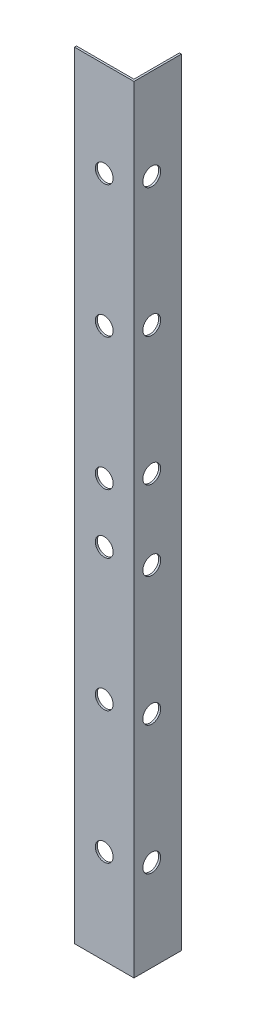
ISO-10303-21;
HEADER;
FILE_DESCRIPTION(('STEP AP214'),'2;1');
FILE_NAME('part.step','',(''),(''),'','','');
FILE_SCHEMA(('AUTOMOTIVE_DESIGN { 1 0 10303 214 1 1 1 1 }'));
ENDSEC;
DATA;
#1=APPLICATION_CONTEXT('core data for automotive mechanical design processes');
#2=APPLICATION_PROTOCOL_DEFINITION('international standard','automotive_design',2000,#1);
#3=PRODUCT_CONTEXT('',#1,'mechanical');
#4=PRODUCT('Part','Part','',(#3));
#5=PRODUCT_RELATED_PRODUCT_CATEGORY('part','',(#4));
#6=PRODUCT_DEFINITION_FORMATION('','',#4);
#7=PRODUCT_DEFINITION_CONTEXT('part definition',#1,'design');
#8=PRODUCT_DEFINITION('design','',#6,#7);
#9=PRODUCT_DEFINITION_SHAPE('','',#8);
#10=(LENGTH_UNIT() NAMED_UNIT(*) SI_UNIT(.MILLI.,.METRE.));
#11=(NAMED_UNIT(*) PLANE_ANGLE_UNIT() SI_UNIT($,.RADIAN.));
#12=(NAMED_UNIT(*) SI_UNIT($,.STERADIAN.) SOLID_ANGLE_UNIT());
#13=UNCERTAINTY_MEASURE_WITH_UNIT(LENGTH_MEASURE(1.E-05),#10,'distance_accuracy_value','');
#14=(GEOMETRIC_REPRESENTATION_CONTEXT(3) GLOBAL_UNCERTAINTY_ASSIGNED_CONTEXT((#13)) GLOBAL_UNIT_ASSIGNED_CONTEXT((#10,
#11,#12)) REPRESENTATION_CONTEXT('',''));
#15=CARTESIAN_POINT('',(0.,0.,0.));
#16=DIRECTION('',(0.,0.,1.));
#17=DIRECTION('',(1.,0.,0.));
#18=AXIS2_PLACEMENT_3D('',#15,#16,#17);
#19=CARTESIAN_POINT('',(0.,196.,-0.5));
#20=DIRECTION('',(1.,0.,0.));
#21=DIRECTION('',(0.,0.,-1.));
#22=AXIS2_PLACEMENT_3D('',#19,#20,#21);
#23=PLANE('',#22);
#24=DIRECTION('',(0.,0.,1.));
#25=VECTOR('',#24,1.);
#26=CARTESIAN_POINT('',(0.,0.,-0.5));
#27=LINE('',#26,#25);
#28=CARTESIAN_POINT('',(0.,0.,-0.5));
#29=VERTEX_POINT('',#28);
#30=CARTESIAN_POINT('',(0.,0.,0.));
#31=VERTEX_POINT('',#30);
#32=EDGE_CURVE('E123',#29,#31,#27,.T.);
#33=ORIENTED_EDGE('',*,*,#32,.T.);
#34=DIRECTION('',(0.,-1.,0.));
#35=VECTOR('',#34,1.);
#36=CARTESIAN_POINT('',(0.,196.,0.));
#37=LINE('',#36,#35);
#38=CARTESIAN_POINT('',(0.,196.,0.));
#39=VERTEX_POINT('',#38);
#40=EDGE_CURVE('E11',#39,#31,#37,.T.);
#41=ORIENTED_EDGE('',*,*,#40,.F.);
#42=DIRECTION('',(0.,0.,1.));
#43=VECTOR('',#42,1.);
#44=CARTESIAN_POINT('',(0.,196.,-0.5));
#45=LINE('',#44,#43);
#46=CARTESIAN_POINT('',(0.,196.,-0.5));
#47=VERTEX_POINT('',#46);
#48=EDGE_CURVE('E134',#47,#39,#45,.T.);
#49=ORIENTED_EDGE('',*,*,#48,.F.);
#50=DIRECTION('',(0.,-1.,0.));
#51=VECTOR('',#50,1.);
#52=CARTESIAN_POINT('',(0.,196.,-0.5));
#53=LINE('',#52,#51);
#54=EDGE_CURVE('E119',#47,#29,#53,.T.);
#55=ORIENTED_EDGE('',*,*,#54,.T.);
#56=EDGE_LOOP('',(#33,#41,#49,#55));
#57=FACE_BOUND('',#56,.T.);
#58=ADVANCED_FACE('F39',(#57),#23,.F.);
#59=CARTESIAN_POINT('',(0.,196.,0.));
#60=DIRECTION('',(0.,0.,-1.));
#61=DIRECTION('',(-1.,0.,0.));
#62=AXIS2_PLACEMENT_3D('',#59,#60,#61);
#63=PLANE('',#62);
#64=CARTESIAN_POINT('',(7.49999999999998,23.8333333333333,0.));
#65=DIRECTION('',(0.,0.,1.));
#66=DIRECTION('',(1.,0.,0.));
#67=AXIS2_PLACEMENT_3D('',#64,#65,#66);
#68=CIRCLE('',#67,2.24999999999999);
#69=CARTESIAN_POINT('',(9.74999999999997,23.8333333333333,0.));
#70=VERTEX_POINT('',#69);
#71=EDGE_CURVE('E421',#70,#70,#68,.T.);
#72=ORIENTED_EDGE('',*,*,#71,.F.);
#73=EDGE_LOOP('',(#72));
#74=FACE_BOUND('',#73,.T.);
#75=CARTESIAN_POINT('',(7.49999999999997,57.1666666666667,0.));
#76=DIRECTION('',(0.,0.,1.));
#77=DIRECTION('',(1.,0.,0.));
#78=AXIS2_PLACEMENT_3D('',#75,#76,#77);
#79=CIRCLE('',#78,2.24999999999999);
#80=CARTESIAN_POINT('',(9.74999999999996,57.1666666666667,0.));
#81=VERTEX_POINT('',#80);
#82=EDGE_CURVE('E429',#81,#81,#79,.T.);
#83=ORIENTED_EDGE('',*,*,#82,.F.);
#84=EDGE_LOOP('',(#83));
#85=FACE_BOUND('',#84,.T.);
#86=CARTESIAN_POINT('',(7.49999999999997,90.5,0.));
#87=DIRECTION('',(0.,0.,1.));
#88=DIRECTION('',(1.,0.,0.));
#89=AXIS2_PLACEMENT_3D('',#86,#87,#88);
#90=CIRCLE('',#89,2.25);
#91=CARTESIAN_POINT('',(9.74999999999997,90.5,0.));
#92=VERTEX_POINT('',#91);
#93=EDGE_CURVE('E435',#92,#92,#90,.T.);
#94=ORIENTED_EDGE('',*,*,#93,.F.);
#95=EDGE_LOOP('',(#94));
#96=FACE_BOUND('',#95,.T.);
#97=CARTESIAN_POINT('',(7.49999999999997,105.5,0.));
#98=DIRECTION('',(0.,0.,1.));
#99=DIRECTION('',(1.,0.,0.));
#100=AXIS2_PLACEMENT_3D('',#97,#98,#99);
#101=CIRCLE('',#100,2.25);
#102=CARTESIAN_POINT('',(9.74999999999997,105.5,0.));
#103=VERTEX_POINT('',#102);
#104=EDGE_CURVE('E441',#103,#103,#101,.T.);
#105=ORIENTED_EDGE('',*,*,#104,.F.);
#106=EDGE_LOOP('',(#105));
#107=FACE_BOUND('',#106,.T.);
#108=CARTESIAN_POINT('',(7.49999999999997,138.833333333333,0.));
#109=DIRECTION('',(0.,0.,1.));
#110=DIRECTION('',(1.,0.,0.));
#111=AXIS2_PLACEMENT_3D('',#108,#109,#110);
#112=CIRCLE('',#111,2.25);
#113=CARTESIAN_POINT('',(9.74999999999997,138.833333333333,0.));
#114=VERTEX_POINT('',#113);
#115=EDGE_CURVE('E447',#114,#114,#112,.T.);
#116=ORIENTED_EDGE('',*,*,#115,.F.);
#117=EDGE_LOOP('',(#116));
#118=FACE_BOUND('',#117,.T.);
#119=CARTESIAN_POINT('',(7.49999999999998,172.166666666667,0.));
#120=DIRECTION('',(0.,0.,1.));
#121=DIRECTION('',(1.,0.,0.));
#122=AXIS2_PLACEMENT_3D('',#119,#120,#121);
#123=CIRCLE('',#122,2.25);
#124=CARTESIAN_POINT('',(9.74999999999998,172.166666666667,0.));
#125=VERTEX_POINT('',#124);
#126=EDGE_CURVE('E453',#125,#125,#123,.T.);
#127=ORIENTED_EDGE('',*,*,#126,.F.);
#128=EDGE_LOOP('',(#127));
#129=FACE_BOUND('',#128,.T.);
#130=DIRECTION('',(1.,0.,0.));
#131=VECTOR('',#130,1.);
#132=CARTESIAN_POINT('',(0.,0.,0.));
#133=LINE('',#132,#131);
#134=CARTESIAN_POINT('',(15.,0.,0.));
#135=VERTEX_POINT('',#134);
#136=EDGE_CURVE('E126',#31,#135,#133,.T.);
#137=ORIENTED_EDGE('',*,*,#136,.T.);
#138=DIRECTION('',(0.,-1.,0.));
#139=VECTOR('',#138,1.);
#140=CARTESIAN_POINT('',(15.,196.,0.));
#141=LINE('',#140,#139);
#142=CARTESIAN_POINT('',(15.,196.,0.));
#143=VERTEX_POINT('',#142);
#144=EDGE_CURVE('E47',#143,#135,#141,.T.);
#145=ORIENTED_EDGE('',*,*,#144,.F.);
#146=DIRECTION('',(1.,0.,0.));
#147=VECTOR('',#146,1.);
#148=CARTESIAN_POINT('',(0.,196.,0.));
#149=LINE('',#148,#147);
#150=EDGE_CURVE('E92',#39,#143,#149,.T.);
#151=ORIENTED_EDGE('',*,*,#150,.F.);
#152=ORIENTED_EDGE('',*,*,#40,.T.);
#153=EDGE_LOOP('',(#137,#145,#151,#152));
#154=FACE_BOUND('',#153,.T.);
#155=ADVANCED_FACE('F164',(#74,#85,#96,#107,#118,#129,#154),#63,.F.);
#156=CARTESIAN_POINT('',(15.,196.,0.));
#157=DIRECTION('',(-1.,0.,0.));
#158=DIRECTION('',(0.,0.,1.));
#159=AXIS2_PLACEMENT_3D('',#156,#157,#158);
#160=PLANE('',#159);
#161=CARTESIAN_POINT('',(15.,23.,-4.49999999999989));
#162=DIRECTION('',(1.,0.,0.));
#163=DIRECTION('',(0.,0.,-1.));
#164=AXIS2_PLACEMENT_3D('',#161,#162,#163);
#165=CIRCLE('',#164,2.25);
#166=CARTESIAN_POINT('',(15.,23.,-6.74999999999989));
#167=VERTEX_POINT('',#166);
#168=EDGE_CURVE('E461',#167,#167,#165,.T.);
#169=ORIENTED_EDGE('',*,*,#168,.F.);
#170=EDGE_LOOP('',(#169));
#171=FACE_BOUND('',#170,.T.);
#172=CARTESIAN_POINT('',(15.,55.5,-4.49999999999992));
#173=DIRECTION('',(1.,0.,0.));
#174=DIRECTION('',(0.,0.,-1.));
#175=AXIS2_PLACEMENT_3D('',#172,#173,#174);
#176=CIRCLE('',#175,2.25);
#177=CARTESIAN_POINT('',(15.,55.5,-6.74999999999992));
#178=VERTEX_POINT('',#177);
#179=EDGE_CURVE('E464',#178,#178,#176,.T.);
#180=ORIENTED_EDGE('',*,*,#179,.F.);
#181=EDGE_LOOP('',(#180));
#182=FACE_BOUND('',#181,.T.);
#183=CARTESIAN_POINT('',(15.,88.0000000000001,-4.50000000000003));
#184=DIRECTION('',(1.,0.,0.));
#185=DIRECTION('',(0.,0.,-1.));
#186=AXIS2_PLACEMENT_3D('',#183,#184,#185);
#187=CIRCLE('',#186,2.25);
#188=CARTESIAN_POINT('',(15.,88.0000000000001,-6.75000000000003));
#189=VERTEX_POINT('',#188);
#190=EDGE_CURVE('E470',#189,#189,#187,.T.);
#191=ORIENTED_EDGE('',*,*,#190,.F.);
#192=EDGE_LOOP('',(#191));
#193=FACE_BOUND('',#192,.T.);
#194=CARTESIAN_POINT('',(15.,108.,-4.50000000000003));
#195=DIRECTION('',(1.,0.,0.));
#196=DIRECTION('',(0.,0.,-1.));
#197=AXIS2_PLACEMENT_3D('',#194,#195,#196);
#198=CIRCLE('',#197,2.25);
#199=CARTESIAN_POINT('',(15.,108.,-6.75000000000003));
#200=VERTEX_POINT('',#199);
#201=EDGE_CURVE('E476',#200,#200,#198,.T.);
#202=ORIENTED_EDGE('',*,*,#201,.F.);
#203=EDGE_LOOP('',(#202));
#204=FACE_BOUND('',#203,.T.);
#205=CARTESIAN_POINT('',(15.,140.5,-4.49999999999992));
#206=DIRECTION('',(1.,0.,0.));
#207=DIRECTION('',(0.,0.,-1.));
#208=AXIS2_PLACEMENT_3D('',#205,#206,#207);
#209=CIRCLE('',#208,2.25);
#210=CARTESIAN_POINT('',(15.,140.5,-6.74999999999992));
#211=VERTEX_POINT('',#210);
#212=EDGE_CURVE('E482',#211,#211,#209,.T.);
#213=ORIENTED_EDGE('',*,*,#212,.F.);
#214=EDGE_LOOP('',(#213));
#215=FACE_BOUND('',#214,.T.);
#216=CARTESIAN_POINT('',(15.,173.,-4.49999999999995));
#217=DIRECTION('',(1.,0.,0.));
#218=DIRECTION('',(0.,0.,-1.));
#219=AXIS2_PLACEMENT_3D('',#216,#217,#218);
#220=CIRCLE('',#219,2.25);
#221=CARTESIAN_POINT('',(15.,173.,-6.74999999999995));
#222=VERTEX_POINT('',#221);
#223=EDGE_CURVE('E427',#222,#222,#220,.T.);
#224=ORIENTED_EDGE('',*,*,#223,.F.);
#225=EDGE_LOOP('',(#224));
#226=FACE_BOUND('',#225,.T.);
#227=DIRECTION('',(0.,0.,-1.));
#228=VECTOR('',#227,1.);
#229=CARTESIAN_POINT('',(15.,0.,0.));
#230=LINE('',#229,#228);
#231=CARTESIAN_POINT('',(15.,0.,-12.));
#232=VERTEX_POINT('',#231);
#233=EDGE_CURVE('E129',#135,#232,#230,.T.);
#234=ORIENTED_EDGE('',*,*,#233,.T.);
#235=DIRECTION('',(0.,-1.,0.));
#236=VECTOR('',#235,1.);
#237=CARTESIAN_POINT('',(15.,196.,-12.));
#238=LINE('',#237,#236);
#239=CARTESIAN_POINT('',(15.,196.,-12.));
#240=VERTEX_POINT('',#239);
#241=EDGE_CURVE('E114',#240,#232,#238,.T.);
#242=ORIENTED_EDGE('',*,*,#241,.F.);
#243=DIRECTION('',(0.,0.,-1.));
#244=VECTOR('',#243,1.);
#245=CARTESIAN_POINT('',(15.,196.,0.));
#246=LINE('',#245,#244);
#247=EDGE_CURVE('E105',#143,#240,#246,.T.);
#248=ORIENTED_EDGE('',*,*,#247,.F.);
#249=ORIENTED_EDGE('',*,*,#144,.T.);
#250=EDGE_LOOP('',(#234,#242,#248,#249));
#251=FACE_BOUND('',#250,.T.);
#252=ADVANCED_FACE('F140',(#171,#182,#193,#204,#215,#226,#251),#160,.F.);
#253=CARTESIAN_POINT('',(15.,196.,-12.));
#254=DIRECTION('',(0.,0.,1.));
#255=DIRECTION('',(1.,0.,0.));
#256=AXIS2_PLACEMENT_3D('',#253,#254,#255);
#257=PLANE('',#256);
#258=DIRECTION('',(-1.,0.,0.));
#259=VECTOR('',#258,1.);
#260=CARTESIAN_POINT('',(15.,0.,-12.));
#261=LINE('',#260,#259);
#262=CARTESIAN_POINT('',(14.5,0.,-12.));
#263=VERTEX_POINT('',#262);
#264=EDGE_CURVE('E113',#232,#263,#261,.T.);
#265=ORIENTED_EDGE('',*,*,#264,.T.);
#266=DIRECTION('',(0.,-1.,0.));
#267=VECTOR('',#266,1.);
#268=CARTESIAN_POINT('',(14.5,196.,-12.));
#269=LINE('',#268,#267);
#270=CARTESIAN_POINT('',(14.5,196.,-12.));
#271=VERTEX_POINT('',#270);
#272=EDGE_CURVE('E110',#271,#263,#269,.T.);
#273=ORIENTED_EDGE('',*,*,#272,.F.);
#274=DIRECTION('',(-1.,0.,0.));
#275=VECTOR('',#274,1.);
#276=CARTESIAN_POINT('',(15.,196.,-12.));
#277=LINE('',#276,#275);
#278=EDGE_CURVE('E99',#240,#271,#277,.T.);
#279=ORIENTED_EDGE('',*,*,#278,.F.);
#280=ORIENTED_EDGE('',*,*,#241,.T.);
#281=EDGE_LOOP('',(#265,#273,#279,#280));
#282=FACE_BOUND('',#281,.T.);
#283=ADVANCED_FACE('F111',(#282),#257,.F.);
#284=CARTESIAN_POINT('',(14.5,196.,-12.));
#285=DIRECTION('',(1.,0.,0.));
#286=DIRECTION('',(0.,0.,-1.));
#287=AXIS2_PLACEMENT_3D('',#284,#285,#286);
#288=PLANE('',#287);
#289=CARTESIAN_POINT('',(14.5,23.,-4.49999999999989));
#290=DIRECTION('',(1.,0.,0.));
#291=DIRECTION('',(0.,0.,-1.));
#292=AXIS2_PLACEMENT_3D('',#289,#290,#291);
#293=CIRCLE('',#292,2.25);
#294=CARTESIAN_POINT('',(14.5,23.,-6.7499999999999));
#295=VERTEX_POINT('',#294);
#296=EDGE_CURVE('E127',#295,#295,#293,.F.);
#297=ORIENTED_EDGE('',*,*,#296,.F.);
#298=EDGE_LOOP('',(#297));
#299=FACE_BOUND('',#298,.T.);
#300=CARTESIAN_POINT('',(14.5,55.5,-4.49999999999992));
#301=DIRECTION('',(1.,0.,0.));
#302=DIRECTION('',(0.,0.,-1.));
#303=AXIS2_PLACEMENT_3D('',#300,#301,#302);
#304=CIRCLE('',#303,2.25);
#305=CARTESIAN_POINT('',(14.5,55.5,-6.74999999999992));
#306=VERTEX_POINT('',#305);
#307=EDGE_CURVE('E467',#306,#306,#304,.F.);
#308=ORIENTED_EDGE('',*,*,#307,.F.);
#309=EDGE_LOOP('',(#308));
#310=FACE_BOUND('',#309,.T.);
#311=CARTESIAN_POINT('',(14.5,88.0000000000001,-4.50000000000003));
#312=DIRECTION('',(1.,0.,0.));
#313=DIRECTION('',(0.,0.,-1.));
#314=AXIS2_PLACEMENT_3D('',#311,#312,#313);
#315=CIRCLE('',#314,2.25);
#316=CARTESIAN_POINT('',(14.5,88.0000000000001,-6.75000000000003));
#317=VERTEX_POINT('',#316);
#318=EDGE_CURVE('E473',#317,#317,#315,.F.);
#319=ORIENTED_EDGE('',*,*,#318,.F.);
#320=EDGE_LOOP('',(#319));
#321=FACE_BOUND('',#320,.T.);
#322=CARTESIAN_POINT('',(14.5,108.,-4.50000000000003));
#323=DIRECTION('',(1.,0.,0.));
#324=DIRECTION('',(0.,0.,-1.));
#325=AXIS2_PLACEMENT_3D('',#322,#323,#324);
#326=CIRCLE('',#325,2.25);
#327=CARTESIAN_POINT('',(14.5,108.,-6.75000000000004));
#328=VERTEX_POINT('',#327);
#329=EDGE_CURVE('E479',#328,#328,#326,.F.);
#330=ORIENTED_EDGE('',*,*,#329,.F.);
#331=EDGE_LOOP('',(#330));
#332=FACE_BOUND('',#331,.T.);
#333=CARTESIAN_POINT('',(14.5,140.5,-4.49999999999992));
#334=DIRECTION('',(1.,0.,0.));
#335=DIRECTION('',(0.,0.,-1.));
#336=AXIS2_PLACEMENT_3D('',#333,#334,#335);
#337=CIRCLE('',#336,2.25);
#338=CARTESIAN_POINT('',(14.5,140.5,-6.74999999999992));
#339=VERTEX_POINT('',#338);
#340=EDGE_CURVE('E485',#339,#339,#337,.F.);
#341=ORIENTED_EDGE('',*,*,#340,.F.);
#342=EDGE_LOOP('',(#341));
#343=FACE_BOUND('',#342,.T.);
#344=CARTESIAN_POINT('',(14.5,173.,-4.49999999999995));
#345=DIRECTION('',(1.,0.,0.));
#346=DIRECTION('',(0.,0.,-1.));
#347=AXIS2_PLACEMENT_3D('',#344,#345,#346);
#348=CIRCLE('',#347,2.25);
#349=CARTESIAN_POINT('',(14.5,173.,-6.74999999999995));
#350=VERTEX_POINT('',#349);
#351=EDGE_CURVE('E424',#350,#350,#348,.F.);
#352=ORIENTED_EDGE('',*,*,#351,.F.);
#353=EDGE_LOOP('',(#352));
#354=FACE_BOUND('',#353,.T.);
#355=DIRECTION('',(0.,0.,1.));
#356=VECTOR('',#355,1.);
#357=CARTESIAN_POINT('',(14.5,0.,-12.));
#358=LINE('',#357,#356);
#359=CARTESIAN_POINT('',(14.5,0.,-0.500000000000002));
#360=VERTEX_POINT('',#359);
#361=EDGE_CURVE('E78',#263,#360,#358,.T.);
#362=ORIENTED_EDGE('',*,*,#361,.T.);
#363=DIRECTION('',(0.,-1.,0.));
#364=VECTOR('',#363,1.);
#365=CARTESIAN_POINT('',(14.5,196.,-0.500000000000002));
#366=LINE('',#365,#364);
#367=CARTESIAN_POINT('',(14.5,196.,-0.500000000000002));
#368=VERTEX_POINT('',#367);
#369=EDGE_CURVE('E115',#368,#360,#366,.T.);
#370=ORIENTED_EDGE('',*,*,#369,.F.);
#371=DIRECTION('',(0.,0.,1.));
#372=VECTOR('',#371,1.);
#373=CARTESIAN_POINT('',(14.5,196.,-12.));
#374=LINE('',#373,#372);
#375=EDGE_CURVE('E103',#271,#368,#374,.T.);
#376=ORIENTED_EDGE('',*,*,#375,.F.);
#377=ORIENTED_EDGE('',*,*,#272,.T.);
#378=EDGE_LOOP('',(#362,#370,#376,#377));
#379=FACE_BOUND('',#378,.T.);
#380=ADVANCED_FACE('F117',(#299,#310,#321,#332,#343,#354,#379),#288,.F.);
#381=CARTESIAN_POINT('',(14.5,196.,-0.500000000000002));
#382=DIRECTION('',(0.,0.,1.));
#383=DIRECTION('',(1.,0.,0.));
#384=AXIS2_PLACEMENT_3D('',#381,#382,#383);
#385=PLANE('',#384);
#386=CARTESIAN_POINT('',(7.49999999999998,23.8333333333333,-0.500000000000002));
#387=DIRECTION('',(0.,0.,1.));
#388=DIRECTION('',(1.,0.,0.));
#389=AXIS2_PLACEMENT_3D('',#386,#387,#388);
#390=CIRCLE('',#389,2.24999999999999);
#391=CARTESIAN_POINT('',(9.74999999999997,23.8333333333333,-0.500000000000002));
#392=VERTEX_POINT('',#391);
#393=EDGE_CURVE('E423',#392,#392,#390,.F.);
#394=ORIENTED_EDGE('',*,*,#393,.F.);
#395=EDGE_LOOP('',(#394));
#396=FACE_BOUND('',#395,.T.);
#397=CARTESIAN_POINT('',(7.49999999999997,57.1666666666667,-0.500000000000002));
#398=DIRECTION('',(0.,0.,1.));
#399=DIRECTION('',(1.,0.,0.));
#400=AXIS2_PLACEMENT_3D('',#397,#398,#399);
#401=CIRCLE('',#400,2.24999999999999);
#402=CARTESIAN_POINT('',(9.74999999999996,57.1666666666667,-0.500000000000002));
#403=VERTEX_POINT('',#402);
#404=EDGE_CURVE('E432',#403,#403,#401,.F.);
#405=ORIENTED_EDGE('',*,*,#404,.F.);
#406=EDGE_LOOP('',(#405));
#407=FACE_BOUND('',#406,.T.);
#408=CARTESIAN_POINT('',(7.49999999999997,90.5,-0.500000000000002));
#409=DIRECTION('',(0.,0.,1.));
#410=DIRECTION('',(1.,0.,0.));
#411=AXIS2_PLACEMENT_3D('',#408,#409,#410);
#412=CIRCLE('',#411,2.25);
#413=CARTESIAN_POINT('',(9.74999999999997,90.5,-0.500000000000002));
#414=VERTEX_POINT('',#413);
#415=EDGE_CURVE('E438',#414,#414,#412,.F.);
#416=ORIENTED_EDGE('',*,*,#415,.F.);
#417=EDGE_LOOP('',(#416));
#418=FACE_BOUND('',#417,.T.);
#419=CARTESIAN_POINT('',(7.49999999999997,105.5,-0.500000000000002));
#420=DIRECTION('',(0.,0.,1.));
#421=DIRECTION('',(1.,0.,0.));
#422=AXIS2_PLACEMENT_3D('',#419,#420,#421);
#423=CIRCLE('',#422,2.25);
#424=CARTESIAN_POINT('',(9.74999999999997,105.5,-0.500000000000002));
#425=VERTEX_POINT('',#424);
#426=EDGE_CURVE('E444',#425,#425,#423,.F.);
#427=ORIENTED_EDGE('',*,*,#426,.F.);
#428=EDGE_LOOP('',(#427));
#429=FACE_BOUND('',#428,.T.);
#430=CARTESIAN_POINT('',(7.49999999999997,138.833333333333,-0.500000000000002));
#431=DIRECTION('',(0.,0.,1.));
#432=DIRECTION('',(1.,0.,0.));
#433=AXIS2_PLACEMENT_3D('',#430,#431,#432);
#434=CIRCLE('',#433,2.25);
#435=CARTESIAN_POINT('',(9.74999999999997,138.833333333333,-0.500000000000002));
#436=VERTEX_POINT('',#435);
#437=EDGE_CURVE('E450',#436,#436,#434,.F.);
#438=ORIENTED_EDGE('',*,*,#437,.F.);
#439=EDGE_LOOP('',(#438));
#440=FACE_BOUND('',#439,.T.);
#441=CARTESIAN_POINT('',(7.49999999999998,172.166666666667,-0.500000000000002));
#442=DIRECTION('',(0.,0.,1.));
#443=DIRECTION('',(1.,0.,0.));
#444=AXIS2_PLACEMENT_3D('',#441,#442,#443);
#445=CIRCLE('',#444,2.25);
#446=CARTESIAN_POINT('',(9.74999999999998,172.166666666667,-0.500000000000002));
#447=VERTEX_POINT('',#446);
#448=EDGE_CURVE('E456',#447,#447,#445,.F.);
#449=ORIENTED_EDGE('',*,*,#448,.F.);
#450=EDGE_LOOP('',(#449));
#451=FACE_BOUND('',#450,.T.);
#452=DIRECTION('',(-1.,0.,0.));
#453=VECTOR('',#452,1.);
#454=CARTESIAN_POINT('',(14.5,0.,-0.500000000000002));
#455=LINE('',#454,#453);
#456=EDGE_CURVE('E84',#360,#29,#455,.T.);
#457=ORIENTED_EDGE('',*,*,#456,.T.);
#458=ORIENTED_EDGE('',*,*,#54,.F.);
#459=DIRECTION('',(-1.,0.,0.));
#460=VECTOR('',#459,1.);
#461=CARTESIAN_POINT('',(14.5,196.,-0.500000000000002));
#462=LINE('',#461,#460);
#463=EDGE_CURVE('E55',#368,#47,#462,.T.);
#464=ORIENTED_EDGE('',*,*,#463,.F.);
#465=ORIENTED_EDGE('',*,*,#369,.T.);
#466=EDGE_LOOP('',(#457,#458,#464,#465));
#467=FACE_BOUND('',#466,.T.);
#468=ADVANCED_FACE('F147',(#396,#407,#418,#429,#440,#451,#467),#385,.F.);
#469=CARTESIAN_POINT('',(0.,196.,0.));
#470=DIRECTION('',(0.,1.,0.));
#471=DIRECTION('',(0.,0.,1.));
#472=AXIS2_PLACEMENT_3D('',#469,#470,#471);
#473=PLANE('',#472);
#474=ORIENTED_EDGE('',*,*,#48,.T.);
#475=ORIENTED_EDGE('',*,*,#150,.T.);
#476=ORIENTED_EDGE('',*,*,#247,.T.);
#477=ORIENTED_EDGE('',*,*,#278,.T.);
#478=ORIENTED_EDGE('',*,*,#375,.T.);
#479=ORIENTED_EDGE('',*,*,#463,.T.);
#480=EDGE_LOOP('',(#474,#475,#476,#477,#478,#479));
#481=FACE_BOUND('',#480,.T.);
#482=ADVANCED_FACE('F101',(#481),#473,.T.);
#483=CARTESIAN_POINT('',(0.,0.,0.));
#484=DIRECTION('',(0.,1.,0.));
#485=DIRECTION('',(0.,0.,1.));
#486=AXIS2_PLACEMENT_3D('',#483,#484,#485);
#487=PLANE('',#486);
#488=ORIENTED_EDGE('',*,*,#32,.F.);
#489=ORIENTED_EDGE('',*,*,#456,.F.);
#490=ORIENTED_EDGE('',*,*,#361,.F.);
#491=ORIENTED_EDGE('',*,*,#264,.F.);
#492=ORIENTED_EDGE('',*,*,#233,.F.);
#493=ORIENTED_EDGE('',*,*,#136,.F.);
#494=EDGE_LOOP('',(#488,#489,#490,#491,#492,#493));
#495=FACE_BOUND('',#494,.T.);
#496=ADVANCED_FACE('F143',(#495),#487,.F.);
#497=CARTESIAN_POINT('',(-0.000999999999999265,173.,-4.49999999999995));
#498=DIRECTION('',(1.,0.,0.));
#499=DIRECTION('',(0.,0.,-1.));
#500=AXIS2_PLACEMENT_3D('',#497,#498,#499);
#501=CYLINDRICAL_SURFACE('',#500,2.25);
#502=ORIENTED_EDGE('',*,*,#223,.T.);
#503=EDGE_LOOP('',(#502));
#504=FACE_BOUND('',#503,.T.);
#505=ORIENTED_EDGE('',*,*,#351,.T.);
#506=EDGE_LOOP('',(#505));
#507=FACE_BOUND('',#506,.T.);
#508=ADVANCED_FACE('F204',(#504,#507),#501,.F.);
#509=CARTESIAN_POINT('',(-0.000999999999999265,140.5,-4.49999999999992));
#510=DIRECTION('',(1.,0.,0.));
#511=DIRECTION('',(0.,0.,-1.));
#512=AXIS2_PLACEMENT_3D('',#509,#510,#511);
#513=CYLINDRICAL_SURFACE('',#512,2.25);
#514=ORIENTED_EDGE('',*,*,#212,.T.);
#515=EDGE_LOOP('',(#514));
#516=FACE_BOUND('',#515,.T.);
#517=ORIENTED_EDGE('',*,*,#340,.T.);
#518=EDGE_LOOP('',(#517));
#519=FACE_BOUND('',#518,.T.);
#520=ADVANCED_FACE('F210',(#516,#519),#513,.F.);
#521=CARTESIAN_POINT('',(-0.000999999999999265,108.,-4.50000000000003));
#522=DIRECTION('',(1.,0.,0.));
#523=DIRECTION('',(0.,0.,-1.));
#524=AXIS2_PLACEMENT_3D('',#521,#522,#523);
#525=CYLINDRICAL_SURFACE('',#524,2.25);
#526=ORIENTED_EDGE('',*,*,#201,.T.);
#527=EDGE_LOOP('',(#526));
#528=FACE_BOUND('',#527,.T.);
#529=ORIENTED_EDGE('',*,*,#329,.T.);
#530=EDGE_LOOP('',(#529));
#531=FACE_BOUND('',#530,.T.);
#532=ADVANCED_FACE('F217',(#528,#531),#525,.F.);
#533=CARTESIAN_POINT('',(-0.000999999999999265,88.0000000000001,-4.50000000000003));
#534=DIRECTION('',(1.,0.,0.));
#535=DIRECTION('',(0.,0.,-1.));
#536=AXIS2_PLACEMENT_3D('',#533,#534,#535);
#537=CYLINDRICAL_SURFACE('',#536,2.25);
#538=ORIENTED_EDGE('',*,*,#190,.T.);
#539=EDGE_LOOP('',(#538));
#540=FACE_BOUND('',#539,.T.);
#541=ORIENTED_EDGE('',*,*,#318,.T.);
#542=EDGE_LOOP('',(#541));
#543=FACE_BOUND('',#542,.T.);
#544=ADVANCED_FACE('F225',(#540,#543),#537,.F.);
#545=CARTESIAN_POINT('',(-0.000999999999999265,55.5,-4.49999999999992));
#546=DIRECTION('',(1.,0.,0.));
#547=DIRECTION('',(0.,0.,-1.));
#548=AXIS2_PLACEMENT_3D('',#545,#546,#547);
#549=CYLINDRICAL_SURFACE('',#548,2.25);
#550=ORIENTED_EDGE('',*,*,#179,.T.);
#551=EDGE_LOOP('',(#550));
#552=FACE_BOUND('',#551,.T.);
#553=ORIENTED_EDGE('',*,*,#307,.T.);
#554=EDGE_LOOP('',(#553));
#555=FACE_BOUND('',#554,.T.);
#556=ADVANCED_FACE('F233',(#552,#555),#549,.F.);
#557=CARTESIAN_POINT('',(-0.000999999999999265,23.,-4.49999999999989));
#558=DIRECTION('',(1.,0.,0.));
#559=DIRECTION('',(0.,0.,-1.));
#560=AXIS2_PLACEMENT_3D('',#557,#558,#559);
#561=CYLINDRICAL_SURFACE('',#560,2.25);
#562=ORIENTED_EDGE('',*,*,#168,.T.);
#563=EDGE_LOOP('',(#562));
#564=FACE_BOUND('',#563,.T.);
#565=ORIENTED_EDGE('',*,*,#296,.T.);
#566=EDGE_LOOP('',(#565));
#567=FACE_BOUND('',#566,.T.);
#568=ADVANCED_FACE('F241',(#564,#567),#561,.F.);
#569=CARTESIAN_POINT('',(7.49999999999998,172.166666666667,-12.001));
#570=DIRECTION('',(0.,0.,1.));
#571=DIRECTION('',(1.,0.,0.));
#572=AXIS2_PLACEMENT_3D('',#569,#570,#571);
#573=CYLINDRICAL_SURFACE('',#572,2.25);
#574=ORIENTED_EDGE('',*,*,#126,.T.);
#575=EDGE_LOOP('',(#574));
#576=FACE_BOUND('',#575,.T.);
#577=ORIENTED_EDGE('',*,*,#448,.T.);
#578=EDGE_LOOP('',(#577));
#579=FACE_BOUND('',#578,.T.);
#580=ADVANCED_FACE('F249',(#576,#579),#573,.F.);
#581=CARTESIAN_POINT('',(7.49999999999997,138.833333333333,-12.001));
#582=DIRECTION('',(0.,0.,1.));
#583=DIRECTION('',(1.,0.,0.));
#584=AXIS2_PLACEMENT_3D('',#581,#582,#583);
#585=CYLINDRICAL_SURFACE('',#584,2.25);
#586=ORIENTED_EDGE('',*,*,#115,.T.);
#587=EDGE_LOOP('',(#586));
#588=FACE_BOUND('',#587,.T.);
#589=ORIENTED_EDGE('',*,*,#437,.T.);
#590=EDGE_LOOP('',(#589));
#591=FACE_BOUND('',#590,.T.);
#592=ADVANCED_FACE('F256',(#588,#591),#585,.F.);
#593=CARTESIAN_POINT('',(7.49999999999997,105.5,-12.001));
#594=DIRECTION('',(0.,0.,1.));
#595=DIRECTION('',(1.,0.,0.));
#596=AXIS2_PLACEMENT_3D('',#593,#594,#595);
#597=CYLINDRICAL_SURFACE('',#596,2.25);
#598=ORIENTED_EDGE('',*,*,#104,.T.);
#599=EDGE_LOOP('',(#598));
#600=FACE_BOUND('',#599,.T.);
#601=ORIENTED_EDGE('',*,*,#426,.T.);
#602=EDGE_LOOP('',(#601));
#603=FACE_BOUND('',#602,.T.);
#604=ADVANCED_FACE('F263',(#600,#603),#597,.F.);
#605=CARTESIAN_POINT('',(7.49999999999997,90.5,-12.001));
#606=DIRECTION('',(0.,0.,1.));
#607=DIRECTION('',(1.,0.,0.));
#608=AXIS2_PLACEMENT_3D('',#605,#606,#607);
#609=CYLINDRICAL_SURFACE('',#608,2.25);
#610=ORIENTED_EDGE('',*,*,#93,.T.);
#611=EDGE_LOOP('',(#610));
#612=FACE_BOUND('',#611,.T.);
#613=ORIENTED_EDGE('',*,*,#415,.T.);
#614=EDGE_LOOP('',(#613));
#615=FACE_BOUND('',#614,.T.);
#616=ADVANCED_FACE('F271',(#612,#615),#609,.F.);
#617=CARTESIAN_POINT('',(7.49999999999997,57.1666666666667,-12.001));
#618=DIRECTION('',(0.,0.,1.));
#619=DIRECTION('',(1.,0.,0.));
#620=AXIS2_PLACEMENT_3D('',#617,#618,#619);
#621=CYLINDRICAL_SURFACE('',#620,2.24999999999999);
#622=ORIENTED_EDGE('',*,*,#82,.T.);
#623=EDGE_LOOP('',(#622));
#624=FACE_BOUND('',#623,.T.);
#625=ORIENTED_EDGE('',*,*,#404,.T.);
#626=EDGE_LOOP('',(#625));
#627=FACE_BOUND('',#626,.T.);
#628=ADVANCED_FACE('F279',(#624,#627),#621,.F.);
#629=CARTESIAN_POINT('',(7.49999999999998,23.8333333333333,-12.001));
#630=DIRECTION('',(0.,0.,1.));
#631=DIRECTION('',(1.,0.,0.));
#632=AXIS2_PLACEMENT_3D('',#629,#630,#631);
#633=CYLINDRICAL_SURFACE('',#632,2.24999999999999);
#634=ORIENTED_EDGE('',*,*,#71,.T.);
#635=EDGE_LOOP('',(#634));
#636=FACE_BOUND('',#635,.T.);
#637=ORIENTED_EDGE('',*,*,#393,.T.);
#638=EDGE_LOOP('',(#637));
#639=FACE_BOUND('',#638,.T.);
#640=ADVANCED_FACE('F287',(#636,#639),#633,.F.);
#641=CLOSED_SHELL('',(#58,#155,#252,#283,#380,#468,#482,#496,#508,#520,#532,#544,#556,#568,#580,
#592,#604,#616,#628,#640));
#642=MANIFOLD_SOLID_BREP('B2',#641);
#643=ADVANCED_BREP_SHAPE_REPRESENTATION('',(#18,#642),#14);
#644=SHAPE_DEFINITION_REPRESENTATION(#9,#643);
ENDSEC;
END-ISO-10303-21;
